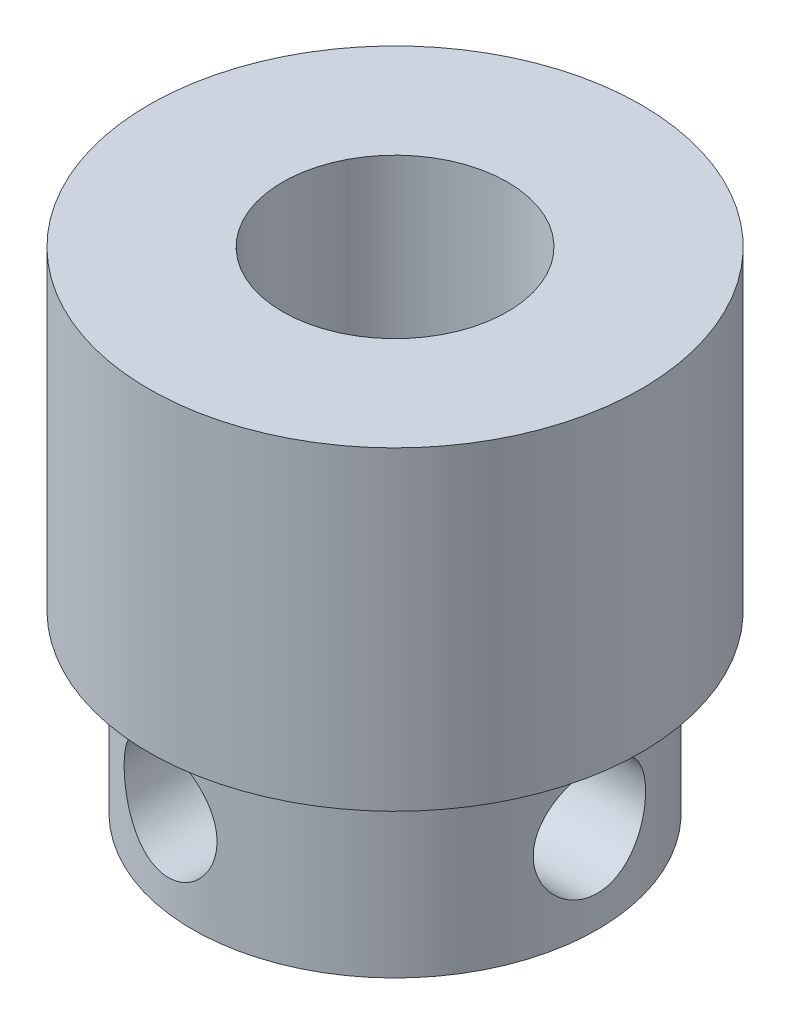
ISO-10303-21;
HEADER;
FILE_DESCRIPTION(('STEP AP214'),'2;1');
FILE_NAME('part.step','',(''),(''),'','','');
FILE_SCHEMA(('AUTOMOTIVE_DESIGN { 1 0 10303 214 1 1 1 1 }'));
ENDSEC;
DATA;
#1=APPLICATION_CONTEXT('core data for automotive mechanical design processes');
#2=APPLICATION_PROTOCOL_DEFINITION('international standard','automotive_design',2000,#1);
#3=PRODUCT_CONTEXT('',#1,'mechanical');
#4=PRODUCT('Part','Part','',(#3));
#5=PRODUCT_RELATED_PRODUCT_CATEGORY('part','',(#4));
#6=PRODUCT_DEFINITION_FORMATION('','',#4);
#7=PRODUCT_DEFINITION_CONTEXT('part definition',#1,'design');
#8=PRODUCT_DEFINITION('design','',#6,#7);
#9=PRODUCT_DEFINITION_SHAPE('','',#8);
#10=(LENGTH_UNIT() NAMED_UNIT(*) SI_UNIT(.MILLI.,.METRE.));
#11=(NAMED_UNIT(*) PLANE_ANGLE_UNIT() SI_UNIT($,.RADIAN.));
#12=(NAMED_UNIT(*) SI_UNIT($,.STERADIAN.) SOLID_ANGLE_UNIT());
#13=UNCERTAINTY_MEASURE_WITH_UNIT(LENGTH_MEASURE(1.E-05),#10,'distance_accuracy_value','');
#14=(GEOMETRIC_REPRESENTATION_CONTEXT(3) GLOBAL_UNCERTAINTY_ASSIGNED_CONTEXT((#13)) GLOBAL_UNIT_ASSIGNED_CONTEXT((#10,
#11,#12)) REPRESENTATION_CONTEXT('',''));
#15=CARTESIAN_POINT('',(0.,0.,0.));
#16=DIRECTION('',(0.,0.,1.));
#17=DIRECTION('',(1.,0.,0.));
#18=AXIS2_PLACEMENT_3D('',#15,#16,#17);
#19=CARTESIAN_POINT('',(75.5,56.42643198464,-56.4));
#20=DIRECTION('',(0.,-1.,0.));
#21=DIRECTION('',(0.,0.,-1.));
#22=AXIS2_PLACEMENT_3D('',#19,#20,#21);
#23=CYLINDRICAL_SURFACE('',#22,5.47499999999999);
#24=CARTESIAN_POINT('',(75.5,56.42643198464,-56.4));
#25=DIRECTION('',(0.,-1.,0.));
#26=DIRECTION('',(0.,0.,-1.));
#27=AXIS2_PLACEMENT_3D('',#24,#25,#26);
#28=CIRCLE('',#27,5.47499999999999);
#29=CARTESIAN_POINT('',(75.5,56.42643198464,-61.875));
#30=VERTEX_POINT('',#29);
#31=EDGE_CURVE('E46',#30,#30,#28,.T.);
#32=ORIENTED_EDGE('',*,*,#31,.T.);
#33=EDGE_LOOP('',(#32));
#34=FACE_BOUND('',#33,.T.);
#35=CARTESIAN_POINT('',(75.5,49.42643198464,-56.4));
#36=DIRECTION('',(0.,-1.,0.));
#37=DIRECTION('',(0.,0.,-1.));
#38=AXIS2_PLACEMENT_3D('',#35,#36,#37);
#39=CIRCLE('',#38,5.47499999999999);
#40=CARTESIAN_POINT('',(75.5,49.42643198464,-61.875));
#41=VERTEX_POINT('',#40);
#42=EDGE_CURVE('E98',#41,#41,#39,.T.);
#43=ORIENTED_EDGE('',*,*,#42,.F.);
#44=EDGE_LOOP('',(#43));
#45=FACE_BOUND('',#44,.T.);
#46=ADVANCED_FACE('F31',(#34,#45),#23,.T.);
#47=CARTESIAN_POINT('',(80.975,56.42643198464,-56.4));
#48=DIRECTION('',(0.,1.,0.));
#49=DIRECTION('',(0.,0.,1.));
#50=AXIS2_PLACEMENT_3D('',#47,#48,#49);
#51=PLANE('',#50);
#52=CARTESIAN_POINT('',(75.5,56.42643198464,-56.4));
#53=DIRECTION('',(0.,1.,0.));
#54=DIRECTION('',(0.,0.,1.));
#55=AXIS2_PLACEMENT_3D('',#52,#53,#54);
#56=CIRCLE('',#55,2.49999999999999);
#57=CARTESIAN_POINT('',(75.5,56.42643198464,-53.9));
#58=VERTEX_POINT('',#57);
#59=EDGE_CURVE('E71',#58,#58,#56,.T.);
#60=ORIENTED_EDGE('',*,*,#59,.F.);
#61=EDGE_LOOP('',(#60));
#62=FACE_BOUND('',#61,.T.);
#63=ORIENTED_EDGE('',*,*,#31,.F.);
#64=EDGE_LOOP('',(#63));
#65=FACE_BOUND('',#64,.T.);
#66=ADVANCED_FACE('F85',(#62,#65),#51,.T.);
#67=CARTESIAN_POINT('',(75.5,49.42643198464,-56.4));
#68=DIRECTION('',(0.,-1.,0.));
#69=DIRECTION('',(0.,0.,-1.));
#70=AXIS2_PLACEMENT_3D('',#67,#68,#69);
#71=PLANE('',#70);
#72=CARTESIAN_POINT('',(75.5,49.42643198464,-56.4));
#73=DIRECTION('',(0.,-1.,0.));
#74=DIRECTION('',(0.,0.,-1.));
#75=AXIS2_PLACEMENT_3D('',#72,#73,#74);
#76=CIRCLE('',#75,4.5);
#77=CARTESIAN_POINT('',(75.5,49.42643198464,-60.9));
#78=VERTEX_POINT('',#77);
#79=EDGE_CURVE('E42',#78,#78,#76,.T.);
#80=ORIENTED_EDGE('',*,*,#79,.F.);
#81=EDGE_LOOP('',(#80));
#82=FACE_BOUND('',#81,.T.);
#83=ORIENTED_EDGE('',*,*,#42,.T.);
#84=EDGE_LOOP('',(#83));
#85=FACE_BOUND('',#84,.T.);
#86=ADVANCED_FACE('F81',(#82,#85),#71,.T.);
#87=CARTESIAN_POINT('',(75.5,45.52643198464,-56.4));
#88=DIRECTION('',(0.,1.,0.));
#89=DIRECTION('',(0.,0.,1.));
#90=AXIS2_PLACEMENT_3D('',#87,#88,#89);
#91=CYLINDRICAL_SURFACE('',#90,4.5);
#92=CARTESIAN_POINT('',(75.5,46.4512673667603,-51.9));
#93=CARTESIAN_POINT('',(75.4447934871534,46.4108011516551,-51.9000007995489));
#94=CARTESIAN_POINT('',(75.3862452187584,46.3748736308886,-51.9010227094612));
#95=CARTESIAN_POINT('',(75.2641385099863,46.3131106322287,-51.9057704950754));
#96=CARTESIAN_POINT('',(75.2005795004463,46.2872763027972,-51.9094966783474));
#97=CARTESIAN_POINT('',(75.0703257750844,46.2463791836178,-51.9200841072514));
#98=CARTESIAN_POINT('',(75.0036307576801,46.2313174321101,-51.9269456549593));
#99=CARTESIAN_POINT('',(74.8690944495684,46.2122540599055,-51.9439305614937));
#100=CARTESIAN_POINT('',(74.8012531744356,46.2082522890527,-51.9540538760347));
#101=CARTESIAN_POINT('',(74.6663028766336,46.2111883218932,-51.9773715176481));
#102=CARTESIAN_POINT('',(74.5991944175725,46.2181340202104,-51.990568055085));
#103=CARTESIAN_POINT('',(74.4674950314561,46.2425249756989,-52.0195337478098));
#104=CARTESIAN_POINT('',(74.4029045994967,46.2599722867276,-52.0353034058969));
#105=CARTESIAN_POINT('',(74.2751402005407,46.3056337893301,-52.0693799622209));
#106=CARTESIAN_POINT('',(74.2121362860678,46.3342647968021,-52.0877650017692));
#107=CARTESIAN_POINT('',(74.0918977324673,46.4013382412809,-52.1255145863717));
#108=CARTESIAN_POINT('',(74.0346652469521,46.4397843220281,-52.1448794930458));
#109=CARTESIAN_POINT('',(73.924450167023,46.5278068054088,-52.1844044995304));
#110=CARTESIAN_POINT('',(73.8718398879763,46.5778556159249,-52.2045539956744));
#111=CARTESIAN_POINT('',(73.7757794567075,46.6866962627329,-52.243108370772));
#112=CARTESIAN_POINT('',(73.7323304696005,46.7454892094672,-52.2615130276567));
#113=CARTESIAN_POINT('',(73.6563148286948,46.8699800888029,-52.2948156277421));
#114=CARTESIAN_POINT('',(73.6236638139904,46.9356189548595,-52.3097404729177));
#115=CARTESIAN_POINT('',(73.5701642136538,47.0723982537278,-52.3347059024144));
#116=CARTESIAN_POINT('',(73.5493053231749,47.1435338211131,-52.3447507501619));
#117=CARTESIAN_POINT('',(73.5217279359434,47.2825658952698,-52.3581372838048));
#118=CARTESIAN_POINT('',(73.5139296344107,47.3501992340556,-52.3619896376257));
#119=CARTESIAN_POINT('',(73.5094404542285,47.4859125179944,-52.3641999518149));
#120=CARTESIAN_POINT('',(73.512745220516,47.5539922775881,-52.3625600664575));
#121=CARTESIAN_POINT('',(73.5296878571154,47.6838605824186,-52.354268186544));
#122=CARTESIAN_POINT('',(73.54262050022,47.7457655328657,-52.3479584297226));
#123=CARTESIAN_POINT('',(73.5774480394105,47.8664233917059,-52.3313191967191));
#124=CARTESIAN_POINT('',(73.599344443835,47.9251757677302,-52.3209890440365));
#125=CARTESIAN_POINT('',(73.6523012565768,48.0403303302844,-52.2967227151429));
#126=CARTESIAN_POINT('',(73.6836725877101,48.0965634976151,-52.2826665685084));
#127=CARTESIAN_POINT('',(73.7542886578378,48.2031461389951,-52.2522333165254));
#128=CARTESIAN_POINT('',(73.7935364892462,48.2534932897944,-52.2358553003252));
#129=CARTESIAN_POINT('',(73.8829583204857,48.3518130974796,-52.2002741416561));
#130=CARTESIAN_POINT('',(73.9338098049749,48.3991268574346,-52.1809499659706));
#131=CARTESIAN_POINT('',(74.0425983930441,48.484700210111,-52.1421465536954));
#132=CARTESIAN_POINT('',(74.1005380857373,48.5229564793314,-52.1226672628903));
#133=CARTESIAN_POINT('',(74.2253877021318,48.5912083902927,-52.0837690245955));
#134=CARTESIAN_POINT('',(74.2926069466148,48.6206729492431,-52.0644055609013));
#135=CARTESIAN_POINT('',(74.431742976568,48.6675107936394,-52.0280450289245));
#136=CARTESIAN_POINT('',(74.5036588495655,48.6848864201539,-52.0110475029793));
#137=CARTESIAN_POINT('',(74.6480222802096,48.7063827684621,-51.9807902579935));
#138=CARTESIAN_POINT('',(74.7203953330186,48.7108696178359,-51.9674372591914));
#139=CARTESIAN_POINT('',(74.8653930190186,48.7071641749319,-51.9443680186512));
#140=CARTESIAN_POINT('',(74.9380175511461,48.6989764930621,-51.9346504561061));
#141=CARTESIAN_POINT('',(75.0772195890296,48.6707349585784,-51.919386410294));
#142=CARTESIAN_POINT('',(75.1439115181985,48.651348169885,-51.9136424342322));
#143=CARTESIAN_POINT('',(75.2733261809906,48.6017125983896,-51.9052447114293));
#144=CARTESIAN_POINT('',(75.3360492496989,48.5714647340158,-51.9025907034766));
#145=CARTESIAN_POINT('',(75.4546187050239,48.5015613803207,-51.8998440206455));
#146=CARTESIAN_POINT('',(75.5105641102254,48.4620750949489,-51.8997084440053));
#147=CARTESIAN_POINT('',(75.61525491831,48.3745230206309,-51.9011710670203));
#148=CARTESIAN_POINT('',(75.6639996669183,48.3264564529279,-51.9027694241163));
#149=CARTESIAN_POINT('',(75.7537606665324,48.2221448126112,-51.9069315216545));
#150=CARTESIAN_POINT('',(75.7946277798904,48.1657720530396,-51.9095115665645));
#151=CARTESIAN_POINT('',(75.8664535673573,48.0470361713949,-51.9148006349314));
#152=CARTESIAN_POINT('',(75.8974115827571,47.9846726514431,-51.917509666949));
#153=CARTESIAN_POINT('',(75.9489071194145,47.8547979278506,-51.9223706413285));
#154=CARTESIAN_POINT('',(75.9693014247537,47.7872295565286,-51.9245147429106));
#155=CARTESIAN_POINT('',(75.9984489667977,47.6496029723677,-51.9276665736962));
#156=CARTESIAN_POINT('',(76.0072027978169,47.5795448868309,-51.9286743609148));
#157=CARTESIAN_POINT('',(76.012798782743,47.4392604662849,-51.9293126233825));
#158=CARTESIAN_POINT('',(76.0096936581898,47.3690362598189,-51.9289491947536));
#159=CARTESIAN_POINT('',(75.9917810946753,47.230111176487,-51.9269439003));
#160=CARTESIAN_POINT('',(75.9769728079402,47.1614104103494,-51.925301941859));
#161=CARTESIAN_POINT('',(75.9361209415579,47.0275921806123,-51.9211367657065));
#162=CARTESIAN_POINT('',(75.910095929159,46.962468994963,-51.918615005655));
#163=CARTESIAN_POINT('',(75.8475495329571,46.8374987495216,-51.9133320637503));
#164=CARTESIAN_POINT('',(75.8110306203297,46.7776504518934,-51.9105709383712));
#165=CARTESIAN_POINT('',(75.7320718968135,46.6697411347022,-51.9058299379808));
#166=CARTESIAN_POINT('',(75.6904126331541,46.6211088941869,-51.9038032652255));
#167=CARTESIAN_POINT('',(75.600138858527,46.5307560705033,-51.9008879668058));
#168=CARTESIAN_POINT('',(75.551524881843,46.4890349569307,-51.8999992537717));
#169=CARTESIAN_POINT('',(75.5,46.4512673667603,-51.9));
#170=B_SPLINE_CURVE_WITH_KNOTS('',3,(#92,#93,#94,#95,#96,#97,#98,#99,#100,#101,#102,#103,#104,
#105,#106,#107,#108,#109,#110,#111,#112,#113,#114,#115,#116,#117,#118,#119,#120,#121,#122,#123,
#124,#125,#126,#127,#128,#129,#130,#131,#132,#133,#134,#135,#136,#137,#138,#139,#140,#141,#142,
#143,#144,#145,#146,#147,#148,#149,#150,#151,#152,#153,#154,#155,#156,#157,#158,#159,#160,#161,
#162,#163,#164,#165,#166,#167,#168,#169),.UNSPECIFIED.,.T.,.F.,(4,2,2,2,2,2,2,2,2,2,2,2,2,2,2,2,
2,2,2,2,2,2,2,2,2,2,2,2,2,2,2,2,2,2,2,2,2,2,4),(0.,0.205123878627019,0.410271090644957,
0.615438071689943,0.820602267268938,1.02591448202131,1.23126686384649,1.44514222865523,
1.65909710814554,1.88410545408743,2.10914239890904,2.33237721517947,2.5554166492935,
2.75889288584246,2.9622893202726,3.15209454625542,3.34193172403879,3.53883898340845,
3.73582370284257,3.95117186470877,4.16659892308645,4.3931944692304,4.61974612204966,
4.83979529987665,5.05976445280093,5.2678136059826,5.47584517037097,5.6803295810787,
5.88483256048416,6.0928918048749,6.30096487716752,6.51178953639598,6.72260343137573,
6.93248120109062,7.14237417568653,7.35192103707387,7.56141859331062,7.7528778004721,
7.94432230700725),.UNSPECIFIED.);
#171=CARTESIAN_POINT('',(75.5,46.4512673667603,-51.9));
#172=VERTEX_POINT('',#171);
#173=EDGE_CURVE('E72',#172,#172,#170,.T.);
#174=ORIENTED_EDGE('',*,*,#173,.T.);
#175=EDGE_LOOP('',(#174));
#176=FACE_BOUND('',#175,.T.);
#177=CARTESIAN_POINT('',(79.8229041164477,47.47643198464,-55.15));
#178=CARTESIAN_POINT('',(79.8229051874701,47.5451754612841,-55.1500014250176));
#179=CARTESIAN_POINT('',(79.824561804683,47.6139336046763,-55.155690112874));
#180=CARTESIAN_POINT('',(79.8309873703651,47.7494562823558,-55.1782465314141));
#181=CARTESIAN_POINT('',(79.8357577089319,47.8162199122789,-55.1951192551796));
#182=CARTESIAN_POINT('',(79.8478296771143,47.9457731480197,-55.2394399565961));
#183=CARTESIAN_POINT('',(79.8551275392773,48.0085685050168,-55.2668722012786));
#184=CARTESIAN_POINT('',(79.8714273753109,48.1286774456677,-55.3314831129126));
#185=CARTESIAN_POINT('',(79.880429522226,48.1859904717827,-55.3686627697153));
#186=CARTESIAN_POINT('',(79.8993974112267,48.2950629124314,-55.4527923404623));
#187=CARTESIAN_POINT('',(79.9093813776994,48.3466515434581,-55.4999596106453));
#188=CARTESIAN_POINT('',(79.9290311990728,48.4412974041597,-55.6022585651999));
#189=CARTESIAN_POINT('',(79.9386970184804,48.4843536846225,-55.6573911345214));
#190=CARTESIAN_POINT('',(79.9568260137099,48.5614342152206,-55.775249785547));
#191=CARTESIAN_POINT('',(79.9652651921364,48.5952872805622,-55.8380918361946));
#192=CARTESIAN_POINT('',(79.9797800915648,48.6518816215198,-55.9688498189753));
#193=CARTESIAN_POINT('',(79.9858562463847,48.674624936927,-56.0367648170546));
#194=CARTESIAN_POINT('',(79.9948315917021,48.7077974573763,-56.1739568198971));
#195=CARTESIAN_POINT('',(79.9978056902535,48.7185175057706,-56.2431585124665));
#196=CARTESIAN_POINT('',(80.0005043369214,48.728255712968,-56.3824377715606));
#197=CARTESIAN_POINT('',(80.0002294733747,48.7272759904183,-56.4525151772114));
#198=CARTESIAN_POINT('',(79.9965154318711,48.7138442084481,-56.5895271235763));
#199=CARTESIAN_POINT('',(79.9931629903763,48.7017066026554,-56.6564952050226));
#200=CARTESIAN_POINT('',(79.9837738004952,48.6668134155237,-56.7874037416612));
#201=CARTESIAN_POINT('',(79.9777368928732,48.6440572043125,-56.851344017003));
#202=CARTESIAN_POINT('',(79.9635312530312,48.5883409443484,-56.9751667958997));
#203=CARTESIAN_POINT('',(79.9553407539217,48.5552760298779,-57.0349995132939));
#204=CARTESIAN_POINT('',(79.9377061067504,48.4799621767301,-57.1483722865441));
#205=CARTESIAN_POINT('',(79.9282616967962,48.437711318294,-57.2019110234201));
#206=CARTESIAN_POINT('',(79.9087683161315,48.3435676557514,-57.3030533801911));
#207=CARTESIAN_POINT('',(79.8987096847725,48.2914010818171,-57.3504006252949));
#208=CARTESIAN_POINT('',(79.8794019157594,48.1797656470789,-57.4357405404255));
#209=CARTESIAN_POINT('',(79.8701528365744,48.1202962595809,-57.4737325351378));
#210=CARTESIAN_POINT('',(79.8534700697197,47.9951496239337,-57.5395011906098));
#211=CARTESIAN_POINT('',(79.8460499003415,47.9294308499866,-57.567202508205));
#212=CARTESIAN_POINT('',(79.8340301124541,47.7940101867612,-57.6110764882178));
#213=CARTESIAN_POINT('',(79.8294297253669,47.7243093885167,-57.6272522922996));
#214=CARTESIAN_POINT('',(79.8237357416584,47.5853147276459,-57.6471622774305));
#215=CARTESIAN_POINT('',(79.822533731607,47.5160803672427,-57.6512812467112));
#216=CARTESIAN_POINT('',(79.8234749436383,47.3779109894179,-57.6480254603074));
#217=CARTESIAN_POINT('',(79.8256177748427,47.3089759379631,-57.6406520476232));
#218=CARTESIAN_POINT('',(79.8329019495553,47.17488311129,-57.614961207142));
#219=CARTESIAN_POINT('',(79.8379784341241,47.1096761502152,-57.5968802993216));
#220=CARTESIAN_POINT('',(79.8504933207908,46.9832218710907,-57.5505562959416));
#221=CARTESIAN_POINT('',(79.85793205026,46.9219751032805,-57.5223117917894));
#222=CARTESIAN_POINT('',(79.8745518120738,46.8035843003608,-57.4556978560791));
#223=CARTESIAN_POINT('',(79.8837697992733,46.7465710991208,-57.4171053363244));
#224=CARTESIAN_POINT('',(79.9028249970542,46.6396888626022,-57.3311636092374));
#225=CARTESIAN_POINT('',(79.9126623340202,46.5898212923078,-57.2838126108033));
#226=CARTESIAN_POINT('',(79.9322250996956,46.4970212493558,-57.1799087182336));
#227=CARTESIAN_POINT('',(79.9419371064794,46.4543585796061,-57.1231117993549));
#228=CARTESIAN_POINT('',(79.9598370143933,46.3791699991013,-57.0029415564347));
#229=CARTESIAN_POINT('',(79.9680249962698,46.3466435512429,-56.9395685810859));
#230=CARTESIAN_POINT('',(79.9819016389374,46.2929571887283,-56.8084891976166));
#231=CARTESIAN_POINT('',(79.9876091198969,46.2717114016064,-56.7408200505253));
#232=CARTESIAN_POINT('',(79.9959647141945,46.2409478979196,-56.6026881564477));
#233=CARTESIAN_POINT('',(79.9986135679142,46.2314273430682,-56.5322260897981));
#234=CARTESIAN_POINT('',(80.0005152110467,46.2245748197969,-56.3930199238212));
#235=CARTESIAN_POINT('',(79.9998778449319,46.2268486310947,-56.3242964677051));
#236=CARTESIAN_POINT('',(79.9955304442323,46.2425962658853,-56.1882496901361));
#237=CARTESIAN_POINT('',(79.9918205429665,46.2560696034249,-56.1209263080631));
#238=CARTESIAN_POINT('',(79.9817699204568,46.2936035964542,-55.9901075082653));
#239=CARTESIAN_POINT('',(79.9754505846841,46.3175782836069,-55.9265856718592));
#240=CARTESIAN_POINT('',(79.9608391014855,46.3753579537553,-55.8044303960586));
#241=CARTESIAN_POINT('',(79.9525466601716,46.4091644013283,-55.745797686643));
#242=CARTESIAN_POINT('',(79.9345769867456,46.4867679559989,-55.6332744391347));
#243=CARTESIAN_POINT('',(79.924867058695,46.5308220276783,-55.5795663667624));
#244=CARTESIAN_POINT('',(79.9052796040056,46.6271909498618,-55.4801721821341));
#245=CARTESIAN_POINT('',(79.895402032703,46.6795080336489,-55.4344882456698));
#246=CARTESIAN_POINT('',(79.8763177677527,46.7924542433757,-55.3513287904518));
#247=CARTESIAN_POINT('',(79.8671333530339,46.85325517946,-55.3140810162227));
#248=CARTESIAN_POINT('',(79.8508019291157,46.9805039782841,-55.2503867367368));
#249=CARTESIAN_POINT('',(79.8436536973308,47.0469484212451,-55.2239337458218));
#250=CARTESIAN_POINT('',(79.8331067287777,47.1736120494986,-55.1857025255952));
#251=CARTESIAN_POINT('',(79.8293133033683,47.2333266874154,-55.1723471829719));
#252=CARTESIAN_POINT('',(79.8242116923493,47.354167808755,-55.1544958975397));
#253=CARTESIAN_POINT('',(79.8229031639202,47.415294096247,-55.1499987326425));
#254=CARTESIAN_POINT('',(79.8229041164477,47.47643198464,-55.15));
#255=B_SPLINE_CURVE_WITH_KNOTS('',3,(#177,#178,#179,#180,#181,#182,#183,#184,#185,#186,#187,
#188,#189,#190,#191,#192,#193,#194,#195,#196,#197,#198,#199,#200,#201,#202,#203,#204,#205,#206,
#207,#208,#209,#210,#211,#212,#213,#214,#215,#216,#217,#218,#219,#220,#221,#222,#223,#224,#225,
#226,#227,#228,#229,#230,#231,#232,#233,#234,#235,#236,#237,#238,#239,#240,#241,#242,#243,#244,
#245,#246,#247,#248,#249,#250,#251,#252,#253,#254),.UNSPECIFIED.,.T.,.F.,(4,2,2,2,2,2,2,2,2,2,2,
2,2,2,2,2,2,2,2,2,2,2,2,2,2,2,2,2,2,2,2,2,2,2,2,2,2,2,4),(0.,0.206005395844474,
0.412102824227255,0.617894362639272,0.823706807313066,1.03456947880014,1.24545559531201,
1.46003098375313,1.67456696053959,1.88379315612368,2.09298146465859,2.29644933759039,
2.49992928132025,2.70555066651712,2.91121506564781,3.1237143777574,3.33622902477097,
3.55027028703841,3.76425318285942,3.97132818882304,4.17837899780671,4.38101838846581,
4.58368587413351,4.79113333818939,4.99862327207951,5.21268753129665,5.42674044564044,
5.63913966265406,5.85148745480909,6.05678432365218,6.26207228502406,6.46571019932809,
6.6693784638795,6.87884344725013,7.0883651408884,7.3030043972912,7.51751450485878,
7.70075331478736,7.88396684302807),.UNSPECIFIED.);
#256=CARTESIAN_POINT('',(79.8229041164477,47.47643198464,-55.15));
#257=VERTEX_POINT('',#256);
#258=EDGE_CURVE('E64',#257,#257,#255,.T.);
#259=ORIENTED_EDGE('',*,*,#258,.T.);
#260=EDGE_LOOP('',(#259));
#261=FACE_BOUND('',#260,.T.);
#262=CARTESIAN_POINT('',(75.5,45.52643198464,-56.4));
#263=DIRECTION('',(0.,-1.,0.));
#264=DIRECTION('',(0.,0.,-1.));
#265=AXIS2_PLACEMENT_3D('',#262,#263,#264);
#266=CIRCLE('',#265,4.5);
#267=CARTESIAN_POINT('',(75.5,45.52643198464,-60.9));
#268=VERTEX_POINT('',#267);
#269=EDGE_CURVE('E100',#268,#268,#266,.T.);
#270=ORIENTED_EDGE('',*,*,#269,.F.);
#271=EDGE_LOOP('',(#270));
#272=FACE_BOUND('',#271,.T.);
#273=ORIENTED_EDGE('',*,*,#79,.T.);
#274=EDGE_LOOP('',(#273));
#275=FACE_BOUND('',#274,.T.);
#276=ADVANCED_FACE('F76',(#176,#261,#272,#275),#91,.T.);
#277=CARTESIAN_POINT('',(75.5,45.52643198464,-56.4));
#278=DIRECTION('',(0.,-1.,0.));
#279=DIRECTION('',(0.,0.,-1.));
#280=AXIS2_PLACEMENT_3D('',#277,#278,#279);
#281=PLANE('',#280);
#282=CARTESIAN_POINT('',(75.5,45.52643198464,-56.4));
#283=DIRECTION('',(0.,1.,0.));
#284=DIRECTION('',(0.,0.,1.));
#285=AXIS2_PLACEMENT_3D('',#282,#283,#284);
#286=CIRCLE('',#285,2.49999999999999);
#287=CARTESIAN_POINT('',(75.5,45.52643198464,-53.9));
#288=VERTEX_POINT('',#287);
#289=EDGE_CURVE('E104',#288,#288,#286,.T.);
#290=ORIENTED_EDGE('',*,*,#289,.T.);
#291=EDGE_LOOP('',(#290));
#292=FACE_BOUND('',#291,.T.);
#293=ORIENTED_EDGE('',*,*,#269,.T.);
#294=EDGE_LOOP('',(#293));
#295=FACE_BOUND('',#294,.T.);
#296=ADVANCED_FACE('F80',(#292,#295),#281,.T.);
#297=CARTESIAN_POINT('',(75.5,56.42643198464,-56.4));
#298=DIRECTION('',(0.,1.,0.));
#299=DIRECTION('',(0.,0.,1.));
#300=AXIS2_PLACEMENT_3D('',#297,#298,#299);
#301=CYLINDRICAL_SURFACE('',#300,2.49999999999999);
#302=CARTESIAN_POINT('',(73.5110003334919,47.4594238491086,-54.8854438516084));
#303=CARTESIAN_POINT('',(73.5109982474503,47.4131018181784,-54.8854479817754));
#304=CARTESIAN_POINT('',(73.5135965738253,47.3667902038007,-54.8820167200552));
#305=CARTESIAN_POINT('',(73.5237353793062,47.2756132911036,-54.8688420987972));
#306=CARTESIAN_POINT('',(73.531282781651,47.2307501113734,-54.8590898971478));
#307=CARTESIAN_POINT('',(73.5536293284651,47.1306265644155,-54.8309093394482));
#308=CARTESIAN_POINT('',(73.5699085618844,47.076189742103,-54.8107726711208));
#309=CARTESIAN_POINT('',(73.608585913172,46.97203817468,-54.7649296457067));
#310=CARTESIAN_POINT('',(73.6309997002182,46.9223359672697,-54.7392090611778));
#311=CARTESIAN_POINT('',(73.692819798135,46.8054476550593,-54.6716927939718));
#312=CARTESIAN_POINT('',(73.7352688612113,46.7409693692903,-54.6280085773737));
#313=CARTESIAN_POINT('',(73.8301256797742,46.6216995254715,-54.5383313655528));
#314=CARTESIAN_POINT('',(73.8825458594631,46.5669202187242,-54.4923355432011));
#315=CARTESIAN_POINT('',(73.9982030304589,46.4661130788843,-54.399944410372));
#316=CARTESIAN_POINT('',(74.0616791177175,46.420340290105,-54.3535681953578));
#317=CARTESIAN_POINT('',(74.1978441812216,46.3406957944375,-54.2643524751433));
#318=CARTESIAN_POINT('',(74.2705169829046,46.3068035780505,-54.2215069736685));
#319=CARTESIAN_POINT('',(74.4083364809219,46.2584562961997,-54.1498834865124));
#320=CARTESIAN_POINT('',(74.4720197333477,46.241453066607,-54.1200148817261));
#321=CARTESIAN_POINT('',(74.6033379952552,46.2176161667911,-54.0652530412577));
#322=CARTESIAN_POINT('',(74.6709706734264,46.2107765588949,-54.0403569079812));
#323=CARTESIAN_POINT('',(74.8087805700313,46.2084281442432,-53.9963623055667));
#324=CARTESIAN_POINT('',(74.8789705022752,46.2129867891881,-53.9772991024774));
#325=CARTESIAN_POINT('',(75.0189712421135,46.2342888753319,-53.9456661827795));
#326=CARTESIAN_POINT('',(75.0887821951272,46.2510272525642,-53.9330937712075));
#327=CARTESIAN_POINT('',(75.2182936260522,46.2942770188312,-53.9151488042942));
#328=CARTESIAN_POINT('',(75.2783025648435,46.3196287586088,-53.9091766677781));
#329=CARTESIAN_POINT('',(75.3938470021402,46.3794987978259,-53.9015835007595));
#330=CARTESIAN_POINT('',(75.4493824893833,46.4140171203419,-53.8999624812109));
#331=CARTESIAN_POINT('',(75.554184063326,46.4911368172958,-53.9000387915928));
#332=CARTESIAN_POINT('',(75.6034720245224,46.5337086107599,-53.90172418273));
#333=CARTESIAN_POINT('',(75.6947948866033,46.6259124871268,-53.9071800605635));
#334=CARTESIAN_POINT('',(75.7368277882813,46.6755465092476,-53.9109511207877));
#335=CARTESIAN_POINT('',(75.8149315359515,46.7838168440099,-53.919585398629));
#336=CARTESIAN_POINT('',(75.8504983083778,46.8428132239862,-53.9245002798668));
#337=CARTESIAN_POINT('',(75.9114887756146,46.965871940242,-53.9339032487048));
#338=CARTESIAN_POINT('',(75.9369112937134,47.0299348631973,-53.9383912867461));
#339=CARTESIAN_POINT('',(75.977406595129,47.1630884240232,-53.9459171756233));
#340=CARTESIAN_POINT('',(75.992208068805,47.2322641881619,-53.9489164455103));
#341=CARTESIAN_POINT('',(76.0099433843029,47.3721760062388,-53.9525437246833));
#342=CARTESIAN_POINT('',(76.0128791612081,47.4429118038715,-53.9531721206155));
#343=CARTESIAN_POINT('',(76.006851385383,47.5824596489154,-53.951917288192));
#344=CARTESIAN_POINT('',(75.9981192158299,47.6512822792863,-53.9500828951867));
#345=CARTESIAN_POINT('',(75.969437216447,47.7864652157727,-53.9444268578117));
#346=CARTESIAN_POINT('',(75.9494860261138,47.8528252222111,-53.9406049724278));
#347=CARTESIAN_POINT('',(75.8988530206243,47.9815277022767,-53.9318884735919));
#348=CARTESIAN_POINT('',(75.8681306409973,48.0438539184697,-53.9269898314446));
#349=CARTESIAN_POINT('',(75.7967864818858,48.1625919559299,-53.9174188598868));
#350=CARTESIAN_POINT('',(75.756162890864,48.2190026921895,-53.9127465720782));
#351=CARTESIAN_POINT('',(75.6653040370044,48.3252770119467,-53.9050484900613));
#352=CARTESIAN_POINT('',(75.614919750839,48.3750156911075,-53.9020514599639));
#353=CARTESIAN_POINT('',(75.5064269757542,48.4653137752237,-53.8994212586644));
#354=CARTESIAN_POINT('',(75.4483214093992,48.5058766376756,-53.8997868182501));
#355=CARTESIAN_POINT('',(75.3285633366719,48.5752090382188,-53.9051931393486));
#356=CARTESIAN_POINT('',(75.267127741209,48.6043662005567,-53.9100567666733));
#357=CARTESIAN_POINT('',(75.1409320214055,48.65219390142,-53.9251061998583));
#358=CARTESIAN_POINT('',(75.0761733206842,48.670868890248,-53.9352897435485));
#359=CARTESIAN_POINT('',(74.9491015411308,48.6968003893606,-53.9606381742313));
#360=CARTESIAN_POINT('',(74.8868413945599,48.7046109912219,-53.9755095641356));
#361=CARTESIAN_POINT('',(74.7632367095902,48.7109537858848,-54.0101669241026));
#362=CARTESIAN_POINT('',(74.701892343634,48.7094842527753,-54.0299538076869));
#363=CARTESIAN_POINT('',(74.5797106271065,48.69777919344,-54.0746105274135));
#364=CARTESIAN_POINT('',(74.5189538650728,48.687261647843,-54.0996240797376));
#365=CARTESIAN_POINT('',(74.4012412588466,48.658071181542,-54.1534635963547));
#366=CARTESIAN_POINT('',(74.3442864254694,48.6393961018792,-54.1822905684918));
#367=CARTESIAN_POINT('',(74.2272792157632,48.591753826666,-54.2470364914194));
#368=CARTESIAN_POINT('',(74.1679028492076,48.5617143973362,-54.2833838108478));
#369=CARTESIAN_POINT('',(74.0555849975391,48.4934536126342,-54.3583737371082));
#370=CARTESIAN_POINT('',(74.0026526605227,48.4552208333706,-54.3970194937056));
#371=CARTESIAN_POINT('',(73.8944715330832,48.3636065789447,-54.4822286935609));
#372=CARTESIAN_POINT('',(73.84059865963,48.3087315340255,-54.5289368960994));
#373=CARTESIAN_POINT('',(73.7430676732453,48.1889955148772,-54.620218772891));
#374=CARTESIAN_POINT('',(73.6993991285016,48.1241448521513,-54.6647945896517));
#375=CARTESIAN_POINT('',(73.6374945166707,48.0096773510047,-54.7319638570995));
#376=CARTESIAN_POINT('',(73.6157963562971,47.9631549023806,-54.7566373185962));
#377=CARTESIAN_POINT('',(73.5777624050039,47.8658347123698,-54.8012946521689));
#378=CARTESIAN_POINT('',(73.5614189824404,47.8150431862949,-54.8212851867231));
#379=CARTESIAN_POINT('',(73.5362304795337,47.714168949461,-54.8527489776503));
#380=CARTESIAN_POINT('',(73.5268555208336,47.6644111593787,-54.8648132558874));
#381=CARTESIAN_POINT('',(73.5142484014458,47.562902755503,-54.8811497755331));
#382=CARTESIAN_POINT('',(73.5110026632063,47.5111568061949,-54.8854392389922));
#383=CARTESIAN_POINT('',(73.5110003334919,47.4594238491086,-54.8854438516084));
#384=B_SPLINE_CURVE_WITH_KNOTS('',3,(#302,#303,#304,#305,#306,#307,#308,#309,#310,#311,#312,
#313,#314,#315,#316,#317,#318,#319,#320,#321,#322,#323,#324,#325,#326,#327,#328,#329,#330,#331,
#332,#333,#334,#335,#336,#337,#338,#339,#340,#341,#342,#343,#344,#345,#346,#347,#348,#349,#350,
#351,#352,#353,#354,#355,#356,#357,#358,#359,#360,#361,#362,#363,#364,#365,#366,#367,#368,#369,
#370,#371,#372,#373,#374,#375,#376,#377,#378,#379,#380,#381,#382,#383),.UNSPECIFIED.,.T.,.F.,(4,
2,2,2,2,2,2,2,2,2,2,2,2,2,2,2,2,2,2,2,2,2,2,2,2,2,2,2,2,2,2,2,2,2,2,2,2,2,2,2,4),(0.,
0.138763925952288,0.27772238340689,0.45755656457318,0.637854444287534,0.902558466151396,
1.16759450085111,1.43930299966235,1.71054010949673,1.92675967425022,2.14285287199425,
2.36022787232072,2.57751254626152,2.77282129649795,2.96813053842041,3.16273585530079,
3.3573947123655,3.56364507786853,3.7699193610202,3.98129148342077,4.19262913341196,
4.39983740371898,4.60707080708859,4.81509318993796,5.02315366141939,5.23468465804123,
5.44613581539625,5.64959909954483,5.85297593602948,6.04554426730197,6.23814841330957,
6.43698280128296,6.63586984433157,6.86249792508712,7.08944407080523,7.35828118851148,
7.626842261729,7.79725314240318,7.96742008389648,8.12273764050365,8.27771072959895),.UNSPECIFIED.);
#385=CARTESIAN_POINT('',(73.5110003334919,47.4594238491086,-54.8854438516084));
#386=VERTEX_POINT('',#385);
#387=EDGE_CURVE('E34',#386,#386,#384,.T.);
#388=ORIENTED_EDGE('',*,*,#387,.T.);
#389=EDGE_LOOP('',(#388));
#390=FACE_BOUND('',#389,.T.);
#391=CARTESIAN_POINT('',(77.6650635094611,47.47643198464,-55.15));
#392=CARTESIAN_POINT('',(77.6650691841057,47.4112972243959,-55.1500045461569));
#393=CARTESIAN_POINT('',(77.668047514847,47.3460802202337,-55.1551250365835));
#394=CARTESIAN_POINT('',(77.6795295806507,47.2176479037936,-55.1753459876274));
#395=CARTESIAN_POINT('',(77.6880449256945,47.1544370908357,-55.1904674193073));
#396=CARTESIAN_POINT('',(77.7093668325675,47.0321174042101,-55.2298750641253));
#397=CARTESIAN_POINT('',(77.7221505434157,46.972988669048,-55.2541125593829));
#398=CARTESIAN_POINT('',(77.7505333102107,46.8596517321441,-55.3109155932796));
#399=CARTESIAN_POINT('',(77.7661325184508,46.8054437968119,-55.3434815824553));
#400=CARTESIAN_POINT('',(77.799960863218,46.6985498239431,-55.4191668243364));
#401=CARTESIAN_POINT('',(77.8183007954744,46.6463580650481,-55.4629349548203));
#402=CARTESIAN_POINT('',(77.8546497848213,46.5496714991316,-55.5584327404819));
#403=CARTESIAN_POINT('',(77.8726586728906,46.5051805314106,-55.6101663427721));
#404=CARTESIAN_POINT('',(77.9077684619118,46.4222230457054,-55.7243880457318));
#405=CARTESIAN_POINT('',(77.9247263302271,46.3843647748156,-55.7873660137343));
#406=CARTESIAN_POINT('',(77.9543844512441,46.3200059180828,-55.9198037167506));
#407=CARTESIAN_POINT('',(77.9670873897968,46.2934981644686,-55.9892593273273));
#408=CARTESIAN_POINT('',(77.986005765553,46.2545511580136,-56.1274438200925));
#409=CARTESIAN_POINT('',(77.9926185027611,46.2412450766956,-56.195872761889));
#410=CARTESIAN_POINT('',(78.0000947980758,46.2262243362962,-56.3342867141277));
#411=CARTESIAN_POINT('',(78.0009618348074,46.2245026636454,-56.4042707573047));
#412=CARTESIAN_POINT('',(77.9970372739556,46.232365327103,-56.5372906555297));
#413=CARTESIAN_POINT('',(77.992731198652,46.2409795040415,-56.600401498971));
#414=CARTESIAN_POINT('',(77.9796780657468,46.2675330395208,-56.7241422148979));
#415=CARTESIAN_POINT('',(77.9709306758299,46.2854730958603,-56.7847719013674));
#416=CARTESIAN_POINT('',(77.9496447910957,46.3302851922523,-56.9028867394619));
#417=CARTESIAN_POINT('',(77.937055519115,46.3572773761051,-56.960316779394));
#418=CARTESIAN_POINT('',(77.9092205748336,46.4192612548919,-57.0699710018917));
#419=CARTESIAN_POINT('',(77.8939739519685,46.454255813768,-57.1221933110483));
#420=CARTESIAN_POINT('',(77.8605549299903,46.5350511740563,-57.2252170761227));
#421=CARTESIAN_POINT('',(77.8422421999772,46.5815607700475,-57.2754175937867));
#422=CARTESIAN_POINT('',(77.8056792573351,46.6821691408027,-57.3676304628722));
#423=CARTESIAN_POINT('',(77.7874291033204,46.7362736999826,-57.4096365144678));
#424=CARTESIAN_POINT('',(77.7518019511561,46.8547422251701,-57.4868816683028));
#425=CARTESIAN_POINT('',(77.7345539998838,46.9195395134578,-57.5215216437226));
#426=CARTESIAN_POINT('',(77.7046931284822,47.0551040738388,-57.5791488912515));
#427=CARTESIAN_POINT('',(77.6920753755758,47.125865025912,-57.6021483227636));
#428=CARTESIAN_POINT('',(77.6743079477129,47.2654501237435,-57.6339752637813));
#429=CARTESIAN_POINT('',(77.6686456981062,47.3339833834444,-57.64378140265));
#430=CARTESIAN_POINT('',(77.6639739920201,47.4719336615357,-57.6518961832643));
#431=CARTESIAN_POINT('',(77.6649598361164,47.5413500210397,-57.6502129466438));
#432=CARTESIAN_POINT('',(77.6729292067573,47.6709993828634,-57.6362950541799));
#433=CARTESIAN_POINT('',(77.6792448438332,47.7314062985249,-57.6252347708906));
#434=CARTESIAN_POINT('',(77.6961752693917,47.8493917174787,-57.5946203557905));
#435=CARTESIAN_POINT('',(77.7067914500629,47.9069692980733,-57.5750634732795));
#436=CARTESIAN_POINT('',(77.7317027759957,48.0206961482684,-57.5270594857561));
#437=CARTESIAN_POINT('',(77.7461455405383,48.0766557557069,-57.4982425796159));
#438=CARTESIAN_POINT('',(77.7769514937156,48.1832685740637,-57.4328588300197));
#439=CARTESIAN_POINT('',(77.7933156669393,48.2339190390316,-57.3962880054153));
#440=CARTESIAN_POINT('',(77.8285999807042,48.3351554440444,-57.3110464589986));
#441=CARTESIAN_POINT('',(77.8475822894286,48.3849284230371,-57.2614315903937));
#442=CARTESIAN_POINT('',(77.8841779372236,48.475697282132,-57.1542556192478));
#443=CARTESIAN_POINT('',(77.9017908125963,48.5166901974282,-57.0966918433192));
#444=CARTESIAN_POINT('',(77.9342670211369,48.5896491420776,-56.9731692031984));
#445=CARTESIAN_POINT('',(77.9490455209004,48.6213483824036,-56.9070288719676));
#446=CARTESIAN_POINT('',(77.9735419369913,48.6728543644617,-56.7694029558013));
#447=CARTESIAN_POINT('',(77.9832642959546,48.6926715488479,-56.6979221267402));
#448=CARTESIAN_POINT('',(77.9958438522735,48.7181426898583,-56.558724602913));
#449=CARTESIAN_POINT('',(77.9992490988524,48.7249293294851,-56.4912643048131));
#450=CARTESIAN_POINT('',(78.0005266296891,48.727486066458,-56.356092517561));
#451=CARTESIAN_POINT('',(77.9984008508361,48.7232600202945,-56.2883811246311));
#452=CARTESIAN_POINT('',(77.989174610474,48.7046614761455,-56.1593275096036));
#453=CARTESIAN_POINT('',(77.9824111833499,48.6909759230679,-56.0978596027359));
#454=CARTESIAN_POINT('',(77.9649011707928,48.6547732355113,-55.9781925597705));
#455=CARTESIAN_POINT('',(77.9541540141599,48.6322548345232,-55.9199938938056));
#456=CARTESIAN_POINT('',(77.9290741343515,48.5780231694325,-55.8057207421939));
#457=CARTESIAN_POINT('',(77.914607714985,48.5459578306302,-55.7498435716249));
#458=CARTESIAN_POINT('',(77.8836016642728,48.4739845710662,-55.6440316977325));
#459=CARTESIAN_POINT('',(77.8670610819795,48.4340730482454,-55.5940997407314));
#460=CARTESIAN_POINT('',(77.8316076278328,48.3429355608616,-55.4963574948039));
#461=CARTESIAN_POINT('',(77.8126224876462,48.2909788752935,-55.4492528943259));
#462=CARTESIAN_POINT('',(77.7757884520356,48.1796185832278,-55.3641708907567));
#463=CARTESIAN_POINT('',(77.7579405720233,48.1202084585554,-55.3262015624874));
#464=CARTESIAN_POINT('',(77.7249950663114,47.9931361764138,-55.2594611502679));
#465=CARTESIAN_POINT('',(77.7100021782034,47.9252725707291,-55.2310186675488));
#466=CARTESIAN_POINT('',(77.6858269541044,47.7847664792153,-55.186401613117));
#467=CARTESIAN_POINT('',(77.6766252018463,47.7121408734991,-55.1701860110308));
#468=CARTESIAN_POINT('',(77.6691159075224,47.611675290075,-55.1570412401695));
#469=CARTESIAN_POINT('',(77.6676016125644,47.5847221166426,-55.1544048687952));
#470=CARTESIAN_POINT('',(77.6655741985969,47.5306613837872,-55.1508832436376));
#471=CARTESIAN_POINT('',(77.6650611465639,47.5035538141577,-55.1499981070002));
#472=CARTESIAN_POINT('',(77.6650635094611,47.47643198464,-55.15));
#473=B_SPLINE_CURVE_WITH_KNOTS('',3,(#391,#392,#393,#394,#395,#396,#397,#398,#399,#400,#401,
#402,#403,#404,#405,#406,#407,#408,#409,#410,#411,#412,#413,#414,#415,#416,#417,#418,#419,#420,
#421,#422,#423,#424,#425,#426,#427,#428,#429,#430,#431,#432,#433,#434,#435,#436,#437,#438,#439,
#440,#441,#442,#443,#444,#445,#446,#447,#448,#449,#450,#451,#452,#453,#454,#455,#456,#457,#458,
#459,#460,#461,#462,#463,#464,#465,#466,#467,#468,#469,#470,#471,#472),.UNSPECIFIED.,.T.,.F.,(4,
2,2,2,2,2,2,2,2,2,2,2,2,2,2,2,2,2,2,2,2,2,2,2,2,2,2,2,2,2,2,2,2,2,2,2,2,2,2,2,4),(0.,
0.195290153243394,0.390991116031003,0.585660744898612,0.780340906806444,0.991077890622784,
1.20191963855462,1.42697365298452,1.65188533704862,1.86079356209916,2.06957529607547,
2.2602012185567,2.45084140646816,2.6441191841393,2.83746624187837,3.0490898932111,
3.26087560307395,3.48611052161807,3.71110967764628,3.9182786356776,4.12530116485462,
4.30967729280028,4.49411315545074,4.68709120507605,4.88016857775054,5.09758429475762,
5.31507331222748,5.53830226766202,5.76133474760958,5.96390337986851,6.16640108492458,
6.35555531089359,6.5447366689001,6.74200938399333,6.93937287625892,7.15637802312576,
7.37357428556435,7.59763436298248,7.82093916253442,7.90225168981629,7.98356965618168),.UNSPECIFIED.);
#474=CARTESIAN_POINT('',(77.6650635094611,47.47643198464,-55.15));
#475=VERTEX_POINT('',#474);
#476=EDGE_CURVE('E10',#475,#475,#473,.T.);
#477=ORIENTED_EDGE('',*,*,#476,.T.);
#478=EDGE_LOOP('',(#477));
#479=FACE_BOUND('',#478,.T.);
#480=ORIENTED_EDGE('',*,*,#289,.F.);
#481=EDGE_LOOP('',(#480));
#482=FACE_BOUND('',#481,.T.);
#483=ORIENTED_EDGE('',*,*,#59,.T.);
#484=EDGE_LOOP('',(#483));
#485=FACE_BOUND('',#484,.T.);
#486=ADVANCED_FACE('F53',(#390,#479,#482,#485),#301,.F.);
#487=CARTESIAN_POINT('',(77.6650635094611,47.47643198464,-56.4));
#488=DIRECTION('',(-1.,0.,0.));
#489=DIRECTION('',(0.,0.,1.));
#490=AXIS2_PLACEMENT_3D('',#487,#488,#489);
#491=CYLINDRICAL_SURFACE('',#490,1.24999999999999);
#492=ORIENTED_EDGE('',*,*,#476,.F.);
#493=EDGE_LOOP('',(#492));
#494=FACE_BOUND('',#493,.T.);
#495=ORIENTED_EDGE('',*,*,#258,.F.);
#496=EDGE_LOOP('',(#495));
#497=FACE_BOUND('',#496,.T.);
#498=ADVANCED_FACE('F56',(#494,#497),#491,.F.);
#499=CARTESIAN_POINT('',(74.7610003334919,47.4594238491086,-54.8854438516084));
#500=DIRECTION('',(0.,0.,-1.));
#501=DIRECTION('',(-1.,0.,0.));
#502=AXIS2_PLACEMENT_3D('',#499,#500,#501);
#503=CYLINDRICAL_SURFACE('',#502,1.24999999999999);
#504=ORIENTED_EDGE('',*,*,#387,.F.);
#505=EDGE_LOOP('',(#504));
#506=FACE_BOUND('',#505,.T.);
#507=ORIENTED_EDGE('',*,*,#173,.F.);
#508=EDGE_LOOP('',(#507));
#509=FACE_BOUND('',#508,.T.);
#510=ADVANCED_FACE('F59',(#506,#509),#503,.F.);
#511=CLOSED_SHELL('',(#46,#66,#86,#276,#296,#486,#498,#510));
#512=MANIFOLD_SOLID_BREP('B2',#511);
#513=ADVANCED_BREP_SHAPE_REPRESENTATION('',(#18,#512),#14);
#514=SHAPE_DEFINITION_REPRESENTATION(#9,#513);
ENDSEC;
END-ISO-10303-21;
